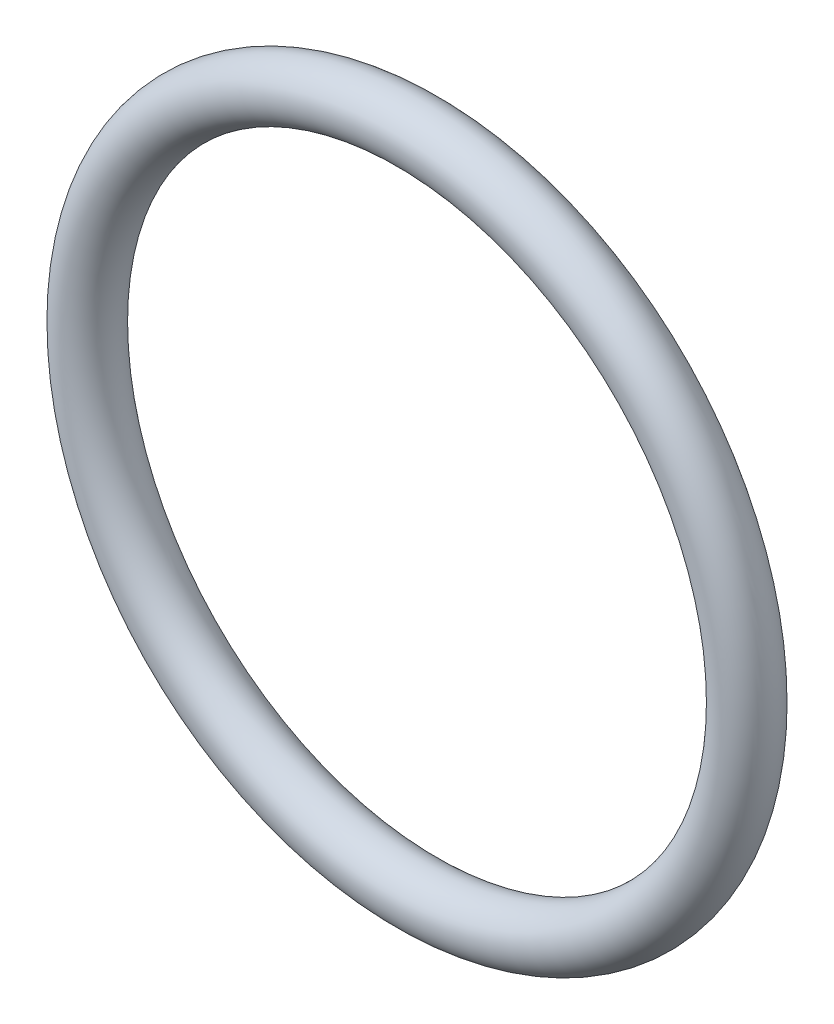
ISO-10303-21;
HEADER;
FILE_DESCRIPTION(('STEP AP214'),'2;1');
FILE_NAME('part.step','',(''),(''),'','','');
FILE_SCHEMA(('AUTOMOTIVE_DESIGN { 1 0 10303 214 1 1 1 1 }'));
ENDSEC;
DATA;
#1=APPLICATION_CONTEXT('core data for automotive mechanical design processes');
#2=APPLICATION_PROTOCOL_DEFINITION('international standard','automotive_design',2000,#1);
#3=PRODUCT_CONTEXT('',#1,'mechanical');
#4=PRODUCT('Part','Part','',(#3));
#5=PRODUCT_RELATED_PRODUCT_CATEGORY('part','',(#4));
#6=PRODUCT_DEFINITION_FORMATION('','',#4);
#7=PRODUCT_DEFINITION_CONTEXT('part definition',#1,'design');
#8=PRODUCT_DEFINITION('design','',#6,#7);
#9=PRODUCT_DEFINITION_SHAPE('','',#8);
#10=(LENGTH_UNIT() NAMED_UNIT(*) SI_UNIT(.MILLI.,.METRE.));
#11=(NAMED_UNIT(*) PLANE_ANGLE_UNIT() SI_UNIT($,.RADIAN.));
#12=(NAMED_UNIT(*) SI_UNIT($,.STERADIAN.) SOLID_ANGLE_UNIT());
#13=UNCERTAINTY_MEASURE_WITH_UNIT(LENGTH_MEASURE(1.E-05),#10,'distance_accuracy_value','');
#14=(GEOMETRIC_REPRESENTATION_CONTEXT(3) GLOBAL_UNCERTAINTY_ASSIGNED_CONTEXT((#13)) GLOBAL_UNIT_ASSIGNED_CONTEXT((#10,
#11,#12)) REPRESENTATION_CONTEXT('',''));
#15=CARTESIAN_POINT('',(0.,0.,0.));
#16=DIRECTION('',(0.,0.,1.));
#17=DIRECTION('',(1.,0.,0.));
#18=AXIS2_PLACEMENT_3D('',#15,#16,#17);
#19=CARTESIAN_POINT('',(0.,0.,0.));
#20=DIRECTION('',(0.,0.,1.));
#21=DIRECTION('',(1.,0.,0.));
#22=AXIS2_PLACEMENT_3D('',#19,#20,#21);
#23=TOROIDAL_SURFACE('',#22,10.2743,0.888999999999998);
#24=CARTESIAN_POINT('',(11.1633,0.,0.));
#25=VERTEX_POINT('',#24);
#26=VERTEX_LOOP('',#25);
#27=FACE_BOUND('',#26,.T.);
#28=ADVANCED_FACE('F33',(#27),#23,.T.);
#29=CLOSED_SHELL('',(#28));
#30=MANIFOLD_SOLID_BREP('B2',#29);
#31=ADVANCED_BREP_SHAPE_REPRESENTATION('',(#18,#30),#14);
#32=SHAPE_DEFINITION_REPRESENTATION(#9,#31);
ENDSEC;
END-ISO-10303-21;
